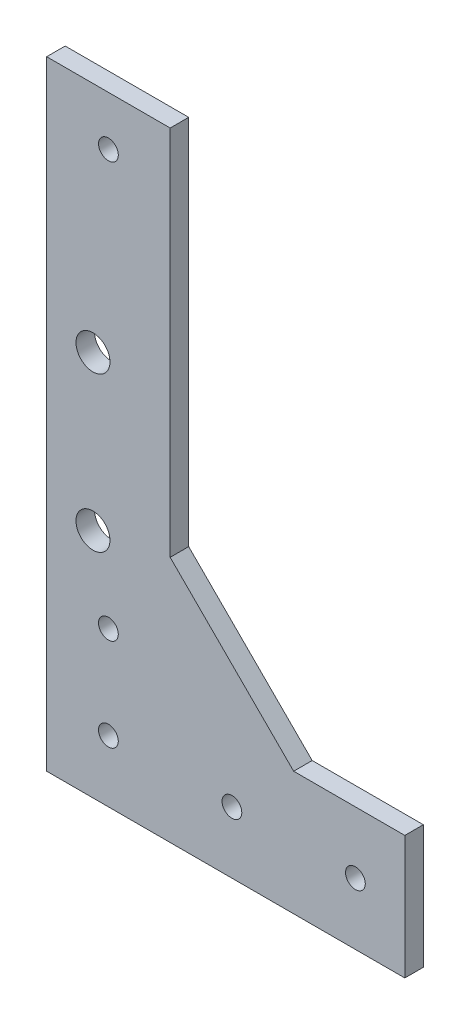
ISO-10303-21;
HEADER;
FILE_DESCRIPTION(('STEP AP214'),'2;1');
FILE_NAME('part.step','',(''),(''),'','','');
FILE_SCHEMA(('AUTOMOTIVE_DESIGN { 1 0 10303 214 1 1 1 1 }'));
ENDSEC;
DATA;
#1=APPLICATION_CONTEXT('core data for automotive mechanical design processes');
#2=APPLICATION_PROTOCOL_DEFINITION('international standard','automotive_design',2000,#1);
#3=PRODUCT_CONTEXT('',#1,'mechanical');
#4=PRODUCT('Part','Part','',(#3));
#5=PRODUCT_RELATED_PRODUCT_CATEGORY('part','',(#4));
#6=PRODUCT_DEFINITION_FORMATION('','',#4);
#7=PRODUCT_DEFINITION_CONTEXT('part definition',#1,'design');
#8=PRODUCT_DEFINITION('design','',#6,#7);
#9=PRODUCT_DEFINITION_SHAPE('','',#8);
#10=(LENGTH_UNIT() NAMED_UNIT(*) SI_UNIT(.MILLI.,.METRE.));
#11=(NAMED_UNIT(*) PLANE_ANGLE_UNIT() SI_UNIT($,.RADIAN.));
#12=(NAMED_UNIT(*) SI_UNIT($,.STERADIAN.) SOLID_ANGLE_UNIT());
#13=UNCERTAINTY_MEASURE_WITH_UNIT(LENGTH_MEASURE(1.E-05),#10,'distance_accuracy_value','');
#14=(GEOMETRIC_REPRESENTATION_CONTEXT(3) GLOBAL_UNCERTAINTY_ASSIGNED_CONTEXT((#13)) GLOBAL_UNIT_ASSIGNED_CONTEXT((#10,
#11,#12)) REPRESENTATION_CONTEXT('',''));
#15=CARTESIAN_POINT('',(0.,0.,0.));
#16=DIRECTION('',(0.,0.,1.));
#17=DIRECTION('',(1.,0.,0.));
#18=AXIS2_PLACEMENT_3D('',#15,#16,#17);
#19=CARTESIAN_POINT('',(-213.489921235063,-7.50295178642777,3.));
#20=DIRECTION('',(0.,-1.,0.));
#21=DIRECTION('',(0.,0.,-1.));
#22=AXIS2_PLACEMENT_3D('',#19,#20,#21);
#23=PLANE('',#22);
#24=DIRECTION('',(-1.,0.,0.));
#25=VECTOR('',#24,1.);
#26=CARTESIAN_POINT('',(-213.489921235063,-7.50295178642777,0.));
#27=LINE('',#26,#25);
#28=CARTESIAN_POINT('',(-195.489923187471,-7.50295178642777,0.));
#29=VERTEX_POINT('',#28);
#30=CARTESIAN_POINT('',(-213.489921235063,-7.50295178642777,0.));
#31=VERTEX_POINT('',#30);
#32=EDGE_CURVE('E124',#29,#31,#27,.T.);
#33=ORIENTED_EDGE('',*,*,#32,.T.);
#34=DIRECTION('',(0.,0.,-1.));
#35=VECTOR('',#34,1.);
#36=CARTESIAN_POINT('',(-213.489921235063,-7.50295178642777,3.));
#37=LINE('',#36,#35);
#38=CARTESIAN_POINT('',(-213.489921235063,-7.50295178642777,3.));
#39=VERTEX_POINT('',#38);
#40=EDGE_CURVE('E11',#39,#31,#37,.T.);
#41=ORIENTED_EDGE('',*,*,#40,.F.);
#42=DIRECTION('',(-1.,0.,0.));
#43=VECTOR('',#42,1.);
#44=CARTESIAN_POINT('',(-213.489921235063,-7.50295178642777,3.));
#45=LINE('',#44,#43);
#46=CARTESIAN_POINT('',(-195.489923187471,-7.50295178642777,3.));
#47=VERTEX_POINT('',#46);
#48=EDGE_CURVE('E137',#47,#39,#45,.T.);
#49=ORIENTED_EDGE('',*,*,#48,.F.);
#50=DIRECTION('',(0.,0.,-1.));
#51=VECTOR('',#50,1.);
#52=CARTESIAN_POINT('',(-195.489923187471,-7.50295178642777,3.));
#53=LINE('',#52,#51);
#54=EDGE_CURVE('E120',#47,#29,#53,.T.);
#55=ORIENTED_EDGE('',*,*,#54,.T.);
#56=EDGE_LOOP('',(#33,#41,#49,#55));
#57=FACE_BOUND('',#56,.T.);
#58=ADVANCED_FACE('F34',(#57),#23,.F.);
#59=CARTESIAN_POINT('',(-233.489921235063,12.4970482135722,3.));
#60=DIRECTION('',(-0.707106781186548,-0.707106781186547,0.));
#61=DIRECTION('',(0.707106781186547,-0.707106781186548,0.));
#62=AXIS2_PLACEMENT_3D('',#59,#60,#61);
#63=PLANE('',#62);
#64=DIRECTION('',(-0.707106781186547,0.707106781186548,0.));
#65=VECTOR('',#64,1.);
#66=CARTESIAN_POINT('',(-233.489921235063,12.4970482135722,0.));
#67=LINE('',#66,#65);
#68=CARTESIAN_POINT('',(-233.489921235063,12.4970482135722,0.));
#69=VERTEX_POINT('',#68);
#70=EDGE_CURVE('E127',#31,#69,#67,.T.);
#71=ORIENTED_EDGE('',*,*,#70,.T.);
#72=DIRECTION('',(0.,0.,-1.));
#73=VECTOR('',#72,1.);
#74=CARTESIAN_POINT('',(-233.489921235063,12.4970482135722,3.));
#75=LINE('',#74,#73);
#76=CARTESIAN_POINT('',(-233.489921235063,12.4970482135722,3.));
#77=VERTEX_POINT('',#76);
#78=EDGE_CURVE('E42',#77,#69,#75,.T.);
#79=ORIENTED_EDGE('',*,*,#78,.F.);
#80=DIRECTION('',(-0.707106781186547,0.707106781186548,0.));
#81=VECTOR('',#80,1.);
#82=CARTESIAN_POINT('',(-233.489921235063,12.4970482135722,3.));
#83=LINE('',#82,#81);
#84=EDGE_CURVE('E90',#39,#77,#83,.T.);
#85=ORIENTED_EDGE('',*,*,#84,.F.);
#86=ORIENTED_EDGE('',*,*,#40,.T.);
#87=EDGE_LOOP('',(#71,#79,#85,#86));
#88=FACE_BOUND('',#87,.T.);
#89=ADVANCED_FACE('F242',(#88),#63,.F.);
#90=CARTESIAN_POINT('',(-233.489921235063,72.709593141673,3.));
#91=DIRECTION('',(-1.,0.,0.));
#92=DIRECTION('',(0.,0.,1.));
#93=AXIS2_PLACEMENT_3D('',#90,#91,#92);
#94=PLANE('',#93);
#95=DIRECTION('',(0.,1.,0.));
#96=VECTOR('',#95,1.);
#97=CARTESIAN_POINT('',(-233.489921235063,72.709593141673,0.));
#98=LINE('',#97,#96);
#99=CARTESIAN_POINT('',(-233.489921235063,72.709593141673,0.));
#100=VERTEX_POINT('',#99);
#101=EDGE_CURVE('E130',#69,#100,#98,.T.);
#102=ORIENTED_EDGE('',*,*,#101,.T.);
#103=DIRECTION('',(0.,0.,-1.));
#104=VECTOR('',#103,1.);
#105=CARTESIAN_POINT('',(-233.489921235063,72.709593141673,3.));
#106=LINE('',#105,#104);
#107=CARTESIAN_POINT('',(-233.489921235063,72.709593141673,3.));
#108=VERTEX_POINT('',#107);
#109=EDGE_CURVE('E141',#108,#100,#106,.T.);
#110=ORIENTED_EDGE('',*,*,#109,.F.);
#111=DIRECTION('',(0.,1.,0.));
#112=VECTOR('',#111,1.);
#113=CARTESIAN_POINT('',(-233.489921235063,72.709593141673,3.));
#114=LINE('',#113,#112);
#115=EDGE_CURVE('E149',#77,#108,#114,.T.);
#116=ORIENTED_EDGE('',*,*,#115,.F.);
#117=ORIENTED_EDGE('',*,*,#78,.T.);
#118=EDGE_LOOP('',(#102,#110,#116,#117));
#119=FACE_BOUND('',#118,.T.);
#120=ADVANCED_FACE('F147',(#119),#94,.F.);
#121=CARTESIAN_POINT('',(-253.489921235063,72.709593141673,3.));
#122=DIRECTION('',(0.,-1.,0.));
#123=DIRECTION('',(0.,0.,-1.));
#124=AXIS2_PLACEMENT_3D('',#121,#122,#123);
#125=PLANE('',#124);
#126=DIRECTION('',(-1.,0.,0.));
#127=VECTOR('',#126,1.);
#128=CARTESIAN_POINT('',(-253.489921235063,72.709593141673,0.));
#129=LINE('',#128,#127);
#130=CARTESIAN_POINT('',(-253.489921235063,72.709593141673,0.));
#131=VERTEX_POINT('',#130);
#132=EDGE_CURVE('E132',#100,#131,#129,.T.);
#133=ORIENTED_EDGE('',*,*,#132,.T.);
#134=DIRECTION('',(0.,0.,-1.));
#135=VECTOR('',#134,1.);
#136=CARTESIAN_POINT('',(-253.489921235063,72.709593141673,3.));
#137=LINE('',#136,#135);
#138=CARTESIAN_POINT('',(-253.489921235063,72.709593141673,3.));
#139=VERTEX_POINT('',#138);
#140=EDGE_CURVE('E115',#139,#131,#137,.T.);
#141=ORIENTED_EDGE('',*,*,#140,.F.);
#142=DIRECTION('',(-1.,0.,0.));
#143=VECTOR('',#142,1.);
#144=CARTESIAN_POINT('',(-253.489921235063,72.709593141673,3.));
#145=LINE('',#144,#143);
#146=EDGE_CURVE('E106',#108,#139,#145,.T.);
#147=ORIENTED_EDGE('',*,*,#146,.F.);
#148=ORIENTED_EDGE('',*,*,#109,.T.);
#149=EDGE_LOOP('',(#133,#141,#147,#148));
#150=FACE_BOUND('',#149,.T.);
#151=ADVANCED_FACE('F155',(#150),#125,.F.);
#152=CARTESIAN_POINT('',(-253.489921235063,72.709593141673,3.));
#153=DIRECTION('',(1.,0.,0.));
#154=DIRECTION('',(0.,0.,-1.));
#155=AXIS2_PLACEMENT_3D('',#152,#153,#154);
#156=PLANE('',#155);
#157=DIRECTION('',(0.,-1.,0.));
#158=VECTOR('',#157,1.);
#159=CARTESIAN_POINT('',(-253.489921235063,72.709593141673,0.));
#160=LINE('',#159,#158);
#161=CARTESIAN_POINT('',(-253.489921235063,-27.5029517864278,0.));
#162=VERTEX_POINT('',#161);
#163=EDGE_CURVE('E114',#131,#162,#160,.T.);
#164=ORIENTED_EDGE('',*,*,#163,.T.);
#165=DIRECTION('',(0.,0.,-1.));
#166=VECTOR('',#165,1.);
#167=CARTESIAN_POINT('',(-253.489921235063,-27.5029517864278,3.));
#168=LINE('',#167,#166);
#169=CARTESIAN_POINT('',(-253.489921235063,-27.5029517864278,3.));
#170=VERTEX_POINT('',#169);
#171=EDGE_CURVE('E111',#170,#162,#168,.T.);
#172=ORIENTED_EDGE('',*,*,#171,.F.);
#173=DIRECTION('',(0.,-1.,0.));
#174=VECTOR('',#173,1.);
#175=CARTESIAN_POINT('',(-253.489921235063,72.709593141673,3.));
#176=LINE('',#175,#174);
#177=EDGE_CURVE('E100',#139,#170,#176,.T.);
#178=ORIENTED_EDGE('',*,*,#177,.F.);
#179=ORIENTED_EDGE('',*,*,#140,.T.);
#180=EDGE_LOOP('',(#164,#172,#178,#179));
#181=FACE_BOUND('',#180,.T.);
#182=ADVANCED_FACE('F112',(#181),#156,.F.);
#183=CARTESIAN_POINT('',(-253.489921235063,-27.5029517864278,3.));
#184=DIRECTION('',(0.,1.,0.));
#185=DIRECTION('',(0.,0.,1.));
#186=AXIS2_PLACEMENT_3D('',#183,#184,#185);
#187=PLANE('',#186);
#188=DIRECTION('',(1.,0.,0.));
#189=VECTOR('',#188,1.);
#190=CARTESIAN_POINT('',(-253.489921235063,-27.5029517864278,0.));
#191=LINE('',#190,#189);
#192=CARTESIAN_POINT('',(-195.489923187471,-27.5029517864278,0.));
#193=VERTEX_POINT('',#192);
#194=EDGE_CURVE('E76',#162,#193,#191,.T.);
#195=ORIENTED_EDGE('',*,*,#194,.T.);
#196=DIRECTION('',(0.,0.,-1.));
#197=VECTOR('',#196,1.);
#198=CARTESIAN_POINT('',(-195.489923187471,-27.5029517864278,3.));
#199=LINE('',#198,#197);
#200=CARTESIAN_POINT('',(-195.489923187471,-27.5029517864278,3.));
#201=VERTEX_POINT('',#200);
#202=EDGE_CURVE('E116',#201,#193,#199,.T.);
#203=ORIENTED_EDGE('',*,*,#202,.F.);
#204=DIRECTION('',(1.,0.,0.));
#205=VECTOR('',#204,1.);
#206=CARTESIAN_POINT('',(-253.489921235063,-27.5029517864278,3.));
#207=LINE('',#206,#205);
#208=EDGE_CURVE('E104',#170,#201,#207,.T.);
#209=ORIENTED_EDGE('',*,*,#208,.F.);
#210=ORIENTED_EDGE('',*,*,#171,.T.);
#211=EDGE_LOOP('',(#195,#203,#209,#210));
#212=FACE_BOUND('',#211,.T.);
#213=ADVANCED_FACE('F118',(#212),#187,.F.);
#214=CARTESIAN_POINT('',(-195.489923187471,-7.50295178642777,3.));
#215=DIRECTION('',(-1.,0.,0.));
#216=DIRECTION('',(0.,0.,1.));
#217=AXIS2_PLACEMENT_3D('',#214,#215,#216);
#218=PLANE('',#217);
#219=DIRECTION('',(0.,1.,0.));
#220=VECTOR('',#219,1.);
#221=CARTESIAN_POINT('',(-195.489923187471,-7.50295178642777,0.));
#222=LINE('',#221,#220);
#223=EDGE_CURVE('E82',#193,#29,#222,.T.);
#224=ORIENTED_EDGE('',*,*,#223,.T.);
#225=ORIENTED_EDGE('',*,*,#54,.F.);
#226=DIRECTION('',(0.,1.,0.));
#227=VECTOR('',#226,1.);
#228=CARTESIAN_POINT('',(-195.489923187471,-7.50295178642777,3.));
#229=LINE('',#228,#227);
#230=EDGE_CURVE('E50',#201,#47,#229,.T.);
#231=ORIENTED_EDGE('',*,*,#230,.F.);
#232=ORIENTED_EDGE('',*,*,#202,.T.);
#233=EDGE_LOOP('',(#224,#225,#231,#232));
#234=FACE_BOUND('',#233,.T.);
#235=ADVANCED_FACE('F213',(#234),#218,.F.);
#236=CARTESIAN_POINT('',(0.,0.,3.));
#237=DIRECTION('',(0.,0.,-1.));
#238=DIRECTION('',(-1.,0.,0.));
#239=AXIS2_PLACEMENT_3D('',#236,#237,#238);
#240=PLANE('',#239);
#241=CARTESIAN_POINT('',(-203.489923187471,-17.5029517864277,3.));
#242=DIRECTION('',(0.,0.,1.));
#243=DIRECTION('',(1.,0.,0.));
#244=AXIS2_PLACEMENT_3D('',#241,#242,#243);
#245=CIRCLE('',#244,1.59999999999999);
#246=CARTESIAN_POINT('',(-201.889923187471,-17.5029517864277,3.));
#247=VERTEX_POINT('',#246);
#248=EDGE_CURVE('E196',#247,#247,#245,.T.);
#249=ORIENTED_EDGE('',*,*,#248,.F.);
#250=EDGE_LOOP('',(#249));
#251=FACE_BOUND('',#250,.T.);
#252=CARTESIAN_POINT('',(-223.489923187471,-17.5029517864277,3.));
#253=DIRECTION('',(0.,0.,1.));
#254=DIRECTION('',(1.,0.,0.));
#255=AXIS2_PLACEMENT_3D('',#252,#253,#254);
#256=CIRCLE('',#255,1.59999999999999);
#257=CARTESIAN_POINT('',(-221.889923187471,-17.5029517864277,3.));
#258=VERTEX_POINT('',#257);
#259=EDGE_CURVE('E190',#258,#258,#256,.T.);
#260=ORIENTED_EDGE('',*,*,#259,.F.);
#261=EDGE_LOOP('',(#260));
#262=FACE_BOUND('',#261,.T.);
#263=CARTESIAN_POINT('',(-243.489923187471,-17.5029517864277,3.));
#264=DIRECTION('',(0.,0.,1.));
#265=DIRECTION('',(1.,0.,0.));
#266=AXIS2_PLACEMENT_3D('',#263,#264,#265);
#267=CIRCLE('',#266,1.60000000000005);
#268=CARTESIAN_POINT('',(-241.889923187471,-17.5029517864277,3.));
#269=VERTEX_POINT('',#268);
#270=EDGE_CURVE('E184',#269,#269,#267,.T.);
#271=ORIENTED_EDGE('',*,*,#270,.F.);
#272=EDGE_LOOP('',(#271));
#273=FACE_BOUND('',#272,.T.);
#274=CARTESIAN_POINT('',(-243.489923187471,-2.50295178642771,3.));
#275=DIRECTION('',(0.,0.,1.));
#276=DIRECTION('',(1.,0.,0.));
#277=AXIS2_PLACEMENT_3D('',#274,#275,#276);
#278=CIRCLE('',#277,1.59999999999996);
#279=CARTESIAN_POINT('',(-241.889923187471,-2.50295178642771,3.));
#280=VERTEX_POINT('',#279);
#281=EDGE_CURVE('E178',#280,#280,#278,.T.);
#282=ORIENTED_EDGE('',*,*,#281,.F.);
#283=EDGE_LOOP('',(#282));
#284=FACE_BOUND('',#283,.T.);
#285=CARTESIAN_POINT('',(-245.989921235074,9.99744821357242,3.));
#286=DIRECTION('',(0.,0.,1.));
#287=DIRECTION('',(1.,0.,0.));
#288=AXIS2_PLACEMENT_3D('',#285,#286,#287);
#289=CIRCLE('',#288,2.74999999999045);
#290=CARTESIAN_POINT('',(-243.239921235084,9.99744821357242,3.));
#291=VERTEX_POINT('',#290);
#292=EDGE_CURVE('E172',#291,#291,#289,.T.);
#293=ORIENTED_EDGE('',*,*,#292,.F.);
#294=EDGE_LOOP('',(#293));
#295=FACE_BOUND('',#294,.T.);
#296=CARTESIAN_POINT('',(-245.989921235074,34.9974482135724,3.));
#297=DIRECTION('',(0.,0.,1.));
#298=DIRECTION('',(1.,0.,0.));
#299=AXIS2_PLACEMENT_3D('',#296,#297,#298);
#300=CIRCLE('',#299,2.74999999999045);
#301=CARTESIAN_POINT('',(-243.239921235084,34.9974482135724,3.));
#302=VERTEX_POINT('',#301);
#303=EDGE_CURVE('E166',#302,#302,#300,.T.);
#304=ORIENTED_EDGE('',*,*,#303,.F.);
#305=EDGE_LOOP('',(#304));
#306=FACE_BOUND('',#305,.T.);
#307=CARTESIAN_POINT('',(-243.489923187471,64.709593141673,3.));
#308=DIRECTION('',(0.,0.,1.));
#309=DIRECTION('',(1.,0.,0.));
#310=AXIS2_PLACEMENT_3D('',#307,#308,#309);
#311=CIRCLE('',#310,1.59999999999999);
#312=CARTESIAN_POINT('',(-241.889923187471,64.709593141673,3.));
#313=VERTEX_POINT('',#312);
#314=EDGE_CURVE('E160',#313,#313,#311,.T.);
#315=ORIENTED_EDGE('',*,*,#314,.F.);
#316=EDGE_LOOP('',(#315));
#317=FACE_BOUND('',#316,.T.);
#318=ORIENTED_EDGE('',*,*,#48,.T.);
#319=ORIENTED_EDGE('',*,*,#84,.T.);
#320=ORIENTED_EDGE('',*,*,#115,.T.);
#321=ORIENTED_EDGE('',*,*,#146,.T.);
#322=ORIENTED_EDGE('',*,*,#177,.T.);
#323=ORIENTED_EDGE('',*,*,#208,.T.);
#324=ORIENTED_EDGE('',*,*,#230,.T.);
#325=EDGE_LOOP('',(#318,#319,#320,#321,#322,#323,#324));
#326=FACE_BOUND('',#325,.T.);
#327=ADVANCED_FACE('F102',(#251,#262,#273,#284,#295,#306,#317,#326),#240,.F.);
#328=CARTESIAN_POINT('',(0.,0.,0.));
#329=DIRECTION('',(0.,0.,-1.));
#330=DIRECTION('',(-1.,0.,0.));
#331=AXIS2_PLACEMENT_3D('',#328,#329,#330);
#332=PLANE('',#331);
#333=CARTESIAN_POINT('',(-203.489923187471,-17.5029517864277,0.));
#334=DIRECTION('',(0.,0.,1.));
#335=DIRECTION('',(1.,0.,0.));
#336=AXIS2_PLACEMENT_3D('',#333,#334,#335);
#337=CIRCLE('',#336,1.59999999999999);
#338=CARTESIAN_POINT('',(-201.889923187471,-17.5029517864277,0.));
#339=VERTEX_POINT('',#338);
#340=EDGE_CURVE('E128',#339,#339,#337,.T.);
#341=ORIENTED_EDGE('',*,*,#340,.T.);
#342=EDGE_LOOP('',(#341));
#343=FACE_BOUND('',#342,.T.);
#344=CARTESIAN_POINT('',(-223.489923187471,-17.5029517864277,0.));
#345=DIRECTION('',(0.,0.,1.));
#346=DIRECTION('',(1.,0.,0.));
#347=AXIS2_PLACEMENT_3D('',#344,#345,#346);
#348=CIRCLE('',#347,1.59999999999999);
#349=CARTESIAN_POINT('',(-221.889923187471,-17.5029517864277,0.));
#350=VERTEX_POINT('',#349);
#351=EDGE_CURVE('E193',#350,#350,#348,.T.);
#352=ORIENTED_EDGE('',*,*,#351,.T.);
#353=EDGE_LOOP('',(#352));
#354=FACE_BOUND('',#353,.T.);
#355=CARTESIAN_POINT('',(-243.489923187471,-17.5029517864277,0.));
#356=DIRECTION('',(0.,0.,1.));
#357=DIRECTION('',(1.,0.,0.));
#358=AXIS2_PLACEMENT_3D('',#355,#356,#357);
#359=CIRCLE('',#358,1.60000000000005);
#360=CARTESIAN_POINT('',(-241.889923187471,-17.5029517864277,0.));
#361=VERTEX_POINT('',#360);
#362=EDGE_CURVE('E187',#361,#361,#359,.T.);
#363=ORIENTED_EDGE('',*,*,#362,.T.);
#364=EDGE_LOOP('',(#363));
#365=FACE_BOUND('',#364,.T.);
#366=CARTESIAN_POINT('',(-243.489923187471,-2.50295178642771,0.));
#367=DIRECTION('',(0.,0.,1.));
#368=DIRECTION('',(1.,0.,0.));
#369=AXIS2_PLACEMENT_3D('',#366,#367,#368);
#370=CIRCLE('',#369,1.59999999999996);
#371=CARTESIAN_POINT('',(-241.889923187471,-2.50295178642771,0.));
#372=VERTEX_POINT('',#371);
#373=EDGE_CURVE('E181',#372,#372,#370,.T.);
#374=ORIENTED_EDGE('',*,*,#373,.T.);
#375=EDGE_LOOP('',(#374));
#376=FACE_BOUND('',#375,.T.);
#377=CARTESIAN_POINT('',(-245.989921235074,9.99744821357242,0.));
#378=DIRECTION('',(0.,0.,1.));
#379=DIRECTION('',(1.,0.,0.));
#380=AXIS2_PLACEMENT_3D('',#377,#378,#379);
#381=CIRCLE('',#380,2.74999999999045);
#382=CARTESIAN_POINT('',(-243.239921235084,9.99744821357242,0.));
#383=VERTEX_POINT('',#382);
#384=EDGE_CURVE('E175',#383,#383,#381,.T.);
#385=ORIENTED_EDGE('',*,*,#384,.T.);
#386=EDGE_LOOP('',(#385));
#387=FACE_BOUND('',#386,.T.);
#388=CARTESIAN_POINT('',(-245.989921235074,34.9974482135724,0.));
#389=DIRECTION('',(0.,0.,1.));
#390=DIRECTION('',(1.,0.,0.));
#391=AXIS2_PLACEMENT_3D('',#388,#389,#390);
#392=CIRCLE('',#391,2.74999999999045);
#393=CARTESIAN_POINT('',(-243.239921235084,34.9974482135724,0.));
#394=VERTEX_POINT('',#393);
#395=EDGE_CURVE('E169',#394,#394,#392,.T.);
#396=ORIENTED_EDGE('',*,*,#395,.T.);
#397=EDGE_LOOP('',(#396));
#398=FACE_BOUND('',#397,.T.);
#399=CARTESIAN_POINT('',(-243.489923187471,64.709593141673,0.));
#400=DIRECTION('',(0.,0.,1.));
#401=DIRECTION('',(1.,0.,0.));
#402=AXIS2_PLACEMENT_3D('',#399,#400,#401);
#403=CIRCLE('',#402,1.59999999999999);
#404=CARTESIAN_POINT('',(-241.889923187471,64.709593141673,0.));
#405=VERTEX_POINT('',#404);
#406=EDGE_CURVE('E163',#405,#405,#403,.T.);
#407=ORIENTED_EDGE('',*,*,#406,.T.);
#408=EDGE_LOOP('',(#407));
#409=FACE_BOUND('',#408,.T.);
#410=ORIENTED_EDGE('',*,*,#32,.F.);
#411=ORIENTED_EDGE('',*,*,#223,.F.);
#412=ORIENTED_EDGE('',*,*,#194,.F.);
#413=ORIENTED_EDGE('',*,*,#163,.F.);
#414=ORIENTED_EDGE('',*,*,#132,.F.);
#415=ORIENTED_EDGE('',*,*,#101,.F.);
#416=ORIENTED_EDGE('',*,*,#70,.F.);
#417=EDGE_LOOP('',(#410,#411,#412,#413,#414,#415,#416));
#418=FACE_BOUND('',#417,.T.);
#419=ADVANCED_FACE('F153',(#343,#354,#365,#376,#387,#398,#409,#418),#332,.T.);
#420=CARTESIAN_POINT('',(-243.489923187471,64.709593141673,0.));
#421=DIRECTION('',(0.,0.,1.));
#422=DIRECTION('',(1.,0.,0.));
#423=AXIS2_PLACEMENT_3D('',#420,#421,#422);
#424=CYLINDRICAL_SURFACE('',#423,1.59999999999999);
#425=ORIENTED_EDGE('',*,*,#406,.F.);
#426=EDGE_LOOP('',(#425));
#427=FACE_BOUND('',#426,.T.);
#428=ORIENTED_EDGE('',*,*,#314,.T.);
#429=EDGE_LOOP('',(#428));
#430=FACE_BOUND('',#429,.T.);
#431=ADVANCED_FACE('F227',(#427,#430),#424,.F.);
#432=CARTESIAN_POINT('',(-245.989921235074,34.9974482135724,0.));
#433=DIRECTION('',(0.,0.,1.));
#434=DIRECTION('',(1.,0.,0.));
#435=AXIS2_PLACEMENT_3D('',#432,#433,#434);
#436=CYLINDRICAL_SURFACE('',#435,2.74999999999045);
#437=ORIENTED_EDGE('',*,*,#395,.F.);
#438=EDGE_LOOP('',(#437));
#439=FACE_BOUND('',#438,.T.);
#440=ORIENTED_EDGE('',*,*,#303,.T.);
#441=EDGE_LOOP('',(#440));
#442=FACE_BOUND('',#441,.T.);
#443=ADVANCED_FACE('F229',(#439,#442),#436,.F.);
#444=CARTESIAN_POINT('',(-245.989921235074,9.99744821357242,0.));
#445=DIRECTION('',(0.,0.,1.));
#446=DIRECTION('',(1.,0.,0.));
#447=AXIS2_PLACEMENT_3D('',#444,#445,#446);
#448=CYLINDRICAL_SURFACE('',#447,2.74999999999045);
#449=ORIENTED_EDGE('',*,*,#384,.F.);
#450=EDGE_LOOP('',(#449));
#451=FACE_BOUND('',#450,.T.);
#452=ORIENTED_EDGE('',*,*,#292,.T.);
#453=EDGE_LOOP('',(#452));
#454=FACE_BOUND('',#453,.T.);
#455=ADVANCED_FACE('F236',(#451,#454),#448,.F.);
#456=CARTESIAN_POINT('',(-243.489923187471,-2.50295178642771,0.));
#457=DIRECTION('',(0.,0.,1.));
#458=DIRECTION('',(1.,0.,0.));
#459=AXIS2_PLACEMENT_3D('',#456,#457,#458);
#460=CYLINDRICAL_SURFACE('',#459,1.59999999999996);
#461=ORIENTED_EDGE('',*,*,#373,.F.);
#462=EDGE_LOOP('',(#461));
#463=FACE_BOUND('',#462,.T.);
#464=ORIENTED_EDGE('',*,*,#281,.T.);
#465=EDGE_LOOP('',(#464));
#466=FACE_BOUND('',#465,.T.);
#467=ADVANCED_FACE('F312',(#463,#466),#460,.F.);
#468=CARTESIAN_POINT('',(-243.489923187471,-17.5029517864277,0.));
#469=DIRECTION('',(0.,0.,1.));
#470=DIRECTION('',(1.,0.,0.));
#471=AXIS2_PLACEMENT_3D('',#468,#469,#470);
#472=CYLINDRICAL_SURFACE('',#471,1.60000000000005);
#473=ORIENTED_EDGE('',*,*,#362,.F.);
#474=EDGE_LOOP('',(#473));
#475=FACE_BOUND('',#474,.T.);
#476=ORIENTED_EDGE('',*,*,#270,.T.);
#477=EDGE_LOOP('',(#476));
#478=FACE_BOUND('',#477,.T.);
#479=ADVANCED_FACE('F322',(#475,#478),#472,.F.);
#480=CARTESIAN_POINT('',(-223.489923187471,-17.5029517864277,0.));
#481=DIRECTION('',(0.,0.,1.));
#482=DIRECTION('',(1.,0.,0.));
#483=AXIS2_PLACEMENT_3D('',#480,#481,#482);
#484=CYLINDRICAL_SURFACE('',#483,1.59999999999999);
#485=ORIENTED_EDGE('',*,*,#351,.F.);
#486=EDGE_LOOP('',(#485));
#487=FACE_BOUND('',#486,.T.);
#488=ORIENTED_EDGE('',*,*,#259,.T.);
#489=EDGE_LOOP('',(#488));
#490=FACE_BOUND('',#489,.T.);
#491=ADVANCED_FACE('F207',(#487,#490),#484,.F.);
#492=CARTESIAN_POINT('',(-203.489923187471,-17.5029517864277,0.));
#493=DIRECTION('',(0.,0.,1.));
#494=DIRECTION('',(1.,0.,0.));
#495=AXIS2_PLACEMENT_3D('',#492,#493,#494);
#496=CYLINDRICAL_SURFACE('',#495,1.59999999999999);
#497=ORIENTED_EDGE('',*,*,#340,.F.);
#498=EDGE_LOOP('',(#497));
#499=FACE_BOUND('',#498,.T.);
#500=ORIENTED_EDGE('',*,*,#248,.T.);
#501=EDGE_LOOP('',(#500));
#502=FACE_BOUND('',#501,.T.);
#503=ADVANCED_FACE('F204',(#499,#502),#496,.F.);
#504=CLOSED_SHELL('',(#58,#89,#120,#151,#182,#213,#235,#327,#419,#431,#443,#455,#467,#479,#491,#503));
#505=MANIFOLD_SOLID_BREP('B2',#504);
#506=ADVANCED_BREP_SHAPE_REPRESENTATION('',(#18,#505),#14);
#507=SHAPE_DEFINITION_REPRESENTATION(#9,#506);
ENDSEC;
END-ISO-10303-21;
